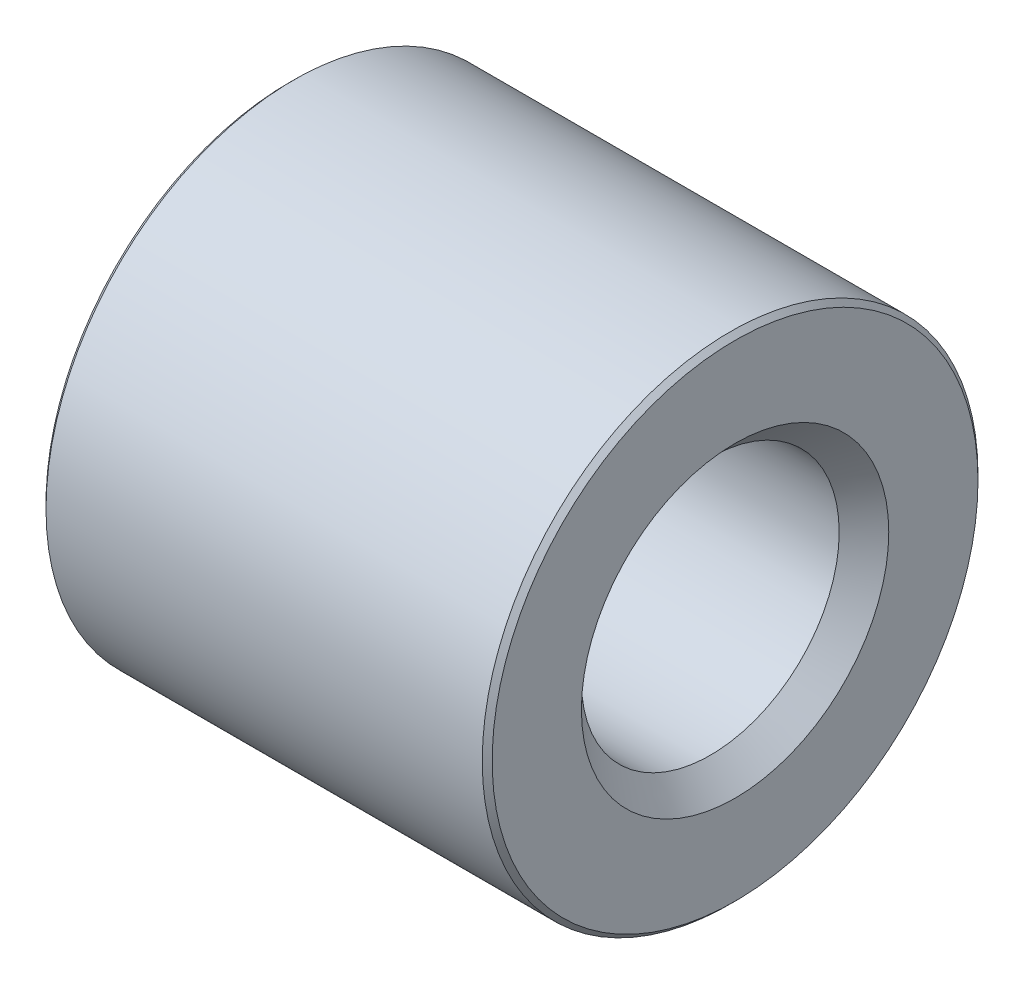
ISO-10303-21;
HEADER;
FILE_DESCRIPTION(('STEP AP214'),'2;1');
FILE_NAME('part.step','',(''),(''),'','','');
FILE_SCHEMA(('AUTOMOTIVE_DESIGN { 1 0 10303 214 1 1 1 1 }'));
ENDSEC;
DATA;
#1=APPLICATION_CONTEXT('core data for automotive mechanical design processes');
#2=APPLICATION_PROTOCOL_DEFINITION('international standard','automotive_design',2000,#1);
#3=PRODUCT_CONTEXT('',#1,'mechanical');
#4=PRODUCT('Part','Part','',(#3));
#5=PRODUCT_RELATED_PRODUCT_CATEGORY('part','',(#4));
#6=PRODUCT_DEFINITION_FORMATION('','',#4);
#7=PRODUCT_DEFINITION_CONTEXT('part definition',#1,'design');
#8=PRODUCT_DEFINITION('design','',#6,#7);
#9=PRODUCT_DEFINITION_SHAPE('','',#8);
#10=(LENGTH_UNIT() NAMED_UNIT(*) SI_UNIT(.MILLI.,.METRE.));
#11=(NAMED_UNIT(*) PLANE_ANGLE_UNIT() SI_UNIT($,.RADIAN.));
#12=(NAMED_UNIT(*) SI_UNIT($,.STERADIAN.) SOLID_ANGLE_UNIT());
#13=UNCERTAINTY_MEASURE_WITH_UNIT(LENGTH_MEASURE(1.E-05),#10,'distance_accuracy_value','');
#14=(GEOMETRIC_REPRESENTATION_CONTEXT(3) GLOBAL_UNCERTAINTY_ASSIGNED_CONTEXT((#13)) GLOBAL_UNIT_ASSIGNED_CONTEXT((#10,
#11,#12)) REPRESENTATION_CONTEXT('',''));
#15=CARTESIAN_POINT('',(0.,0.,0.));
#16=DIRECTION('',(0.,0.,1.));
#17=DIRECTION('',(1.,0.,0.));
#18=AXIS2_PLACEMENT_3D('',#15,#16,#17);
#19=CARTESIAN_POINT('',(9.,0.,0.));
#20=DIRECTION('',(1.,0.,0.));
#21=DIRECTION('',(0.,0.,-1.));
#22=AXIS2_PLACEMENT_3D('',#19,#20,#21);
#23=PLANE('',#22);
#24=CARTESIAN_POINT('',(9.,0.,0.));
#25=DIRECTION('',(1.,0.,0.));
#26=DIRECTION('',(0.,0.,-1.));
#27=AXIS2_PLACEMENT_3D('',#24,#25,#26);
#28=CIRCLE('',#27,4.9);
#29=CARTESIAN_POINT('',(9.,0.,-4.9));
#30=VERTEX_POINT('',#29);
#31=EDGE_CURVE('E8',#30,#30,#28,.T.);
#32=ORIENTED_EDGE('',*,*,#31,.T.);
#33=EDGE_LOOP('',(#32));
#34=FACE_BOUND('',#33,.T.);
#35=CARTESIAN_POINT('',(9.,0.,0.));
#36=DIRECTION('',(1.,0.,0.));
#37=DIRECTION('',(0.,0.,-1.));
#38=AXIS2_PLACEMENT_3D('',#35,#36,#37);
#39=CIRCLE('',#38,3.1);
#40=CARTESIAN_POINT('',(9.,0.,-3.1));
#41=VERTEX_POINT('',#40);
#42=EDGE_CURVE('E33',#41,#41,#39,.F.);
#43=ORIENTED_EDGE('',*,*,#42,.T.);
#44=EDGE_LOOP('',(#43));
#45=FACE_BOUND('',#44,.T.);
#46=ADVANCED_FACE('F13',(#34,#45),#23,.T.);
#47=CARTESIAN_POINT('',(0.,0.,0.));
#48=DIRECTION('',(1.,0.,0.));
#49=DIRECTION('',(0.,0.,-1.));
#50=AXIS2_PLACEMENT_3D('',#47,#48,#49);
#51=PLANE('',#50);
#52=CARTESIAN_POINT('',(0.,0.,0.));
#53=DIRECTION('',(1.,0.,0.));
#54=DIRECTION('',(0.,0.,-1.));
#55=AXIS2_PLACEMENT_3D('',#52,#53,#54);
#56=CIRCLE('',#55,4.9);
#57=CARTESIAN_POINT('',(0.,0.,-4.9));
#58=VERTEX_POINT('',#57);
#59=EDGE_CURVE('E20',#58,#58,#56,.F.);
#60=ORIENTED_EDGE('',*,*,#59,.T.);
#61=EDGE_LOOP('',(#60));
#62=FACE_BOUND('',#61,.T.);
#63=CARTESIAN_POINT('',(0.,0.,0.));
#64=DIRECTION('',(1.,0.,0.));
#65=DIRECTION('',(0.,0.,-1.));
#66=AXIS2_PLACEMENT_3D('',#63,#64,#65);
#67=CIRCLE('',#66,2.6);
#68=CARTESIAN_POINT('',(0.,0.,-2.6));
#69=VERTEX_POINT('',#68);
#70=EDGE_CURVE('E39',#69,#69,#67,.T.);
#71=ORIENTED_EDGE('',*,*,#70,.T.);
#72=EDGE_LOOP('',(#71));
#73=FACE_BOUND('',#72,.T.);
#74=ADVANCED_FACE('F43',(#62,#73),#51,.F.);
#75=CARTESIAN_POINT('',(9.,0.,0.));
#76=DIRECTION('',(-1.,0.,0.));
#77=DIRECTION('',(0.,0.,1.));
#78=AXIS2_PLACEMENT_3D('',#75,#76,#77);
#79=CYLINDRICAL_SURFACE('',#78,5.);
#80=CARTESIAN_POINT('',(0.100000000000001,0.,0.));
#81=DIRECTION('',(1.,0.,0.));
#82=DIRECTION('',(0.,0.,-1.));
#83=AXIS2_PLACEMENT_3D('',#80,#81,#82);
#84=CIRCLE('',#83,5.);
#85=CARTESIAN_POINT('',(0.100000000000001,0.,-5.));
#86=VERTEX_POINT('',#85);
#87=EDGE_CURVE('E24',#86,#86,#84,.T.);
#88=ORIENTED_EDGE('',*,*,#87,.T.);
#89=EDGE_LOOP('',(#88));
#90=FACE_BOUND('',#89,.T.);
#91=CARTESIAN_POINT('',(8.9,0.,0.));
#92=DIRECTION('',(1.,0.,0.));
#93=DIRECTION('',(0.,0.,-1.));
#94=AXIS2_PLACEMENT_3D('',#91,#92,#93);
#95=CIRCLE('',#94,5.);
#96=CARTESIAN_POINT('',(8.9,0.,-5.));
#97=VERTEX_POINT('',#96);
#98=EDGE_CURVE('E28',#97,#97,#95,.F.);
#99=ORIENTED_EDGE('',*,*,#98,.T.);
#100=EDGE_LOOP('',(#99));
#101=FACE_BOUND('',#100,.T.);
#102=ADVANCED_FACE('F48',(#90,#101),#79,.T.);
#103=CARTESIAN_POINT('',(9.,0.,0.));
#104=DIRECTION('',(-1.,0.,0.));
#105=DIRECTION('',(0.,0.,1.));
#106=AXIS2_PLACEMENT_3D('',#103,#104,#105);
#107=CYLINDRICAL_SURFACE('',#106,2.6);
#108=CARTESIAN_POINT('',(8.5,0.,0.));
#109=DIRECTION('',(1.,0.,0.));
#110=DIRECTION('',(0.,0.,-1.));
#111=AXIS2_PLACEMENT_3D('',#108,#109,#110);
#112=CIRCLE('',#111,2.6);
#113=CARTESIAN_POINT('',(8.5,0.,-2.6));
#114=VERTEX_POINT('',#113);
#115=EDGE_CURVE('E36',#114,#114,#112,.T.);
#116=ORIENTED_EDGE('',*,*,#115,.T.);
#117=EDGE_LOOP('',(#116));
#118=FACE_BOUND('',#117,.T.);
#119=ORIENTED_EDGE('',*,*,#70,.F.);
#120=EDGE_LOOP('',(#119));
#121=FACE_BOUND('',#120,.T.);
#122=ADVANCED_FACE('F45',(#118,#121),#107,.F.);
#123=CARTESIAN_POINT('',(8.5,0.,0.));
#124=DIRECTION('',(1.,0.,0.));
#125=DIRECTION('',(0.,0.,-1.));
#126=AXIS2_PLACEMENT_3D('',#123,#124,#125);
#127=CONICAL_SURFACE('',#126,2.6,0.78539816339745);
#128=ORIENTED_EDGE('',*,*,#42,.F.);
#129=EDGE_LOOP('',(#128));
#130=FACE_BOUND('',#129,.T.);
#131=ORIENTED_EDGE('',*,*,#115,.F.);
#132=EDGE_LOOP('',(#131));
#133=FACE_BOUND('',#132,.T.);
#134=ADVANCED_FACE('F47',(#130,#133),#127,.F.);
#135=CARTESIAN_POINT('',(0.100000000000001,0.,0.));
#136=DIRECTION('',(1.,0.,0.));
#137=DIRECTION('',(0.,0.,-1.));
#138=AXIS2_PLACEMENT_3D('',#135,#136,#137);
#139=CONICAL_SURFACE('',#138,5.,0.785398163397453);
#140=ORIENTED_EDGE('',*,*,#59,.F.);
#141=EDGE_LOOP('',(#140));
#142=FACE_BOUND('',#141,.T.);
#143=ORIENTED_EDGE('',*,*,#87,.F.);
#144=EDGE_LOOP('',(#143));
#145=FACE_BOUND('',#144,.T.);
#146=ADVANCED_FACE('F56',(#142,#145),#139,.T.);
#147=CARTESIAN_POINT('',(9.,0.,0.));
#148=DIRECTION('',(-1.,0.,0.));
#149=DIRECTION('',(0.,0.,1.));
#150=AXIS2_PLACEMENT_3D('',#147,#148,#149);
#151=CONICAL_SURFACE('',#150,4.9,0.785398163397444);
#152=ORIENTED_EDGE('',*,*,#98,.F.);
#153=EDGE_LOOP('',(#152));
#154=FACE_BOUND('',#153,.T.);
#155=ORIENTED_EDGE('',*,*,#31,.F.);
#156=EDGE_LOOP('',(#155));
#157=FACE_BOUND('',#156,.T.);
#158=ADVANCED_FACE('F15',(#154,#157),#151,.T.);
#159=CLOSED_SHELL('',(#46,#74,#102,#122,#134,#146,#158));
#160=MANIFOLD_SOLID_BREP('B1',#159);
#161=ADVANCED_BREP_SHAPE_REPRESENTATION('',(#18,#160),#14);
#162=SHAPE_DEFINITION_REPRESENTATION(#9,#161);
ENDSEC;
END-ISO-10303-21;
